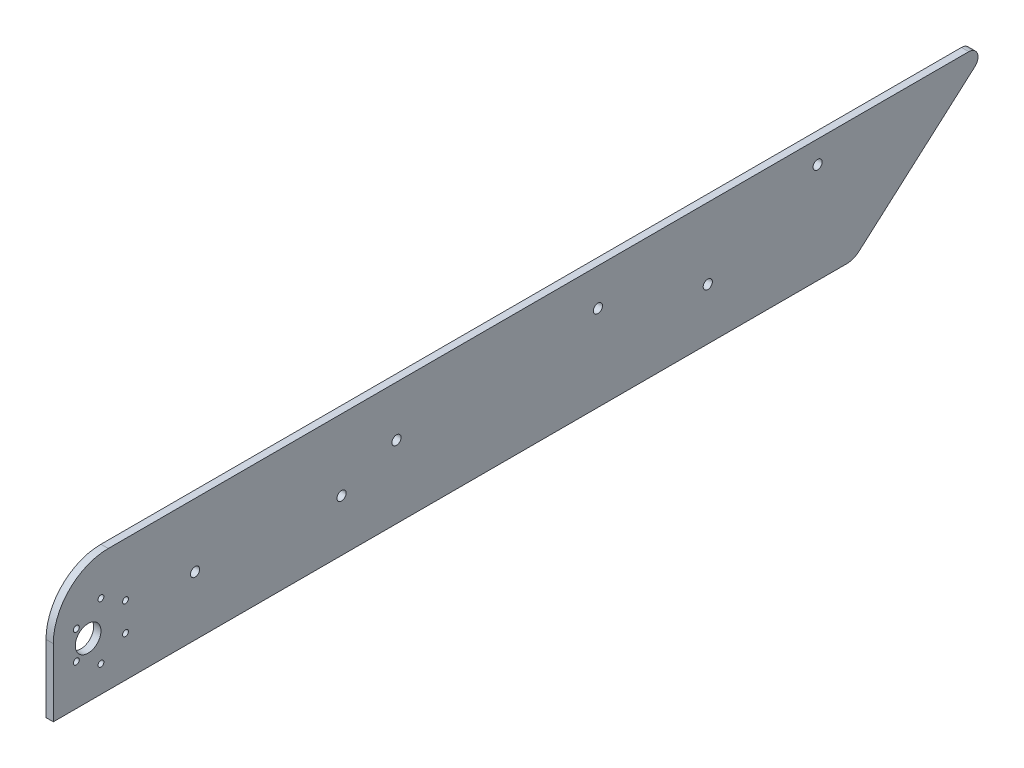
ISO-10303-21;
HEADER;
FILE_DESCRIPTION(('STEP AP214'),'2;1');
FILE_NAME('part.step','',(''),(''),'','','');
FILE_SCHEMA(('AUTOMOTIVE_DESIGN { 1 0 10303 214 1 1 1 1 }'));
ENDSEC;
DATA;
#1=APPLICATION_CONTEXT('core data for automotive mechanical design processes');
#2=APPLICATION_PROTOCOL_DEFINITION('international standard','automotive_design',2000,#1);
#3=PRODUCT_CONTEXT('',#1,'mechanical');
#4=PRODUCT('Part','Part','',(#3));
#5=PRODUCT_RELATED_PRODUCT_CATEGORY('part','',(#4));
#6=PRODUCT_DEFINITION_FORMATION('','',#4);
#7=PRODUCT_DEFINITION_CONTEXT('part definition',#1,'design');
#8=PRODUCT_DEFINITION('design','',#6,#7);
#9=PRODUCT_DEFINITION_SHAPE('','',#8);
#10=(LENGTH_UNIT() NAMED_UNIT(*) SI_UNIT(.MILLI.,.METRE.));
#11=(NAMED_UNIT(*) PLANE_ANGLE_UNIT() SI_UNIT($,.RADIAN.));
#12=(NAMED_UNIT(*) SI_UNIT($,.STERADIAN.) SOLID_ANGLE_UNIT());
#13=UNCERTAINTY_MEASURE_WITH_UNIT(LENGTH_MEASURE(1.E-05),#10,'distance_accuracy_value','');
#14=(GEOMETRIC_REPRESENTATION_CONTEXT(3) GLOBAL_UNCERTAINTY_ASSIGNED_CONTEXT((#13)) GLOBAL_UNIT_ASSIGNED_CONTEXT((#10,
#11,#12)) REPRESENTATION_CONTEXT('',''));
#15=CARTESIAN_POINT('',(0.,0.,0.));
#16=DIRECTION('',(0.,0.,1.));
#17=DIRECTION('',(1.,0.,0.));
#18=AXIS2_PLACEMENT_3D('',#15,#16,#17);
#19=CARTESIAN_POINT('',(-4.,2.99999999999992,-206.943801284862));
#20=DIRECTION('',(-1.,0.,0.));
#21=DIRECTION('',(0.,0.,1.));
#22=AXIS2_PLACEMENT_3D('',#19,#20,#21);
#23=PLANE('',#22);
#24=CARTESIAN_POINT('',(-4.,7.50688926243503,200.406668197782));
#25=DIRECTION('',(-1.,0.,0.));
#26=DIRECTION('',(0.,0.,1.));
#27=AXIS2_PLACEMENT_3D('',#24,#25,#26);
#28=CIRCLE('',#27,1.60000000000002);
#29=CARTESIAN_POINT('',(-4.,7.50688926243503,202.006668197782));
#30=VERTEX_POINT('',#29);
#31=EDGE_CURVE('E213',#30,#30,#28,.T.);
#32=ORIENTED_EDGE('',*,*,#31,.F.);
#33=EDGE_LOOP('',(#32));
#34=FACE_BOUND('',#33,.T.);
#35=CARTESIAN_POINT('',(-4.,30.7568892624349,186.983274439123));
#36=DIRECTION('',(-1.,0.,0.));
#37=DIRECTION('',(0.,0.,1.));
#38=AXIS2_PLACEMENT_3D('',#35,#36,#37);
#39=CIRCLE('',#38,1.60000000000002);
#40=CARTESIAN_POINT('',(-4.,30.7568892624349,188.583274439123));
#41=VERTEX_POINT('',#40);
#42=EDGE_CURVE('E201',#41,#41,#39,.T.);
#43=ORIENTED_EDGE('',*,*,#42,.F.);
#44=EDGE_LOOP('',(#43));
#45=FACE_BOUND('',#44,.T.);
#46=CARTESIAN_POINT('',(-4.,30.7568892624349,213.830061956441));
#47=DIRECTION('',(-1.,0.,0.));
#48=DIRECTION('',(0.,0.,1.));
#49=AXIS2_PLACEMENT_3D('',#46,#47,#48);
#50=CIRCLE('',#49,1.60000000000002);
#51=CARTESIAN_POINT('',(-4.,30.7568892624349,215.430061956441));
#52=VERTEX_POINT('',#51);
#53=EDGE_CURVE('E189',#52,#52,#50,.T.);
#54=ORIENTED_EDGE('',*,*,#53,.F.);
#55=EDGE_LOOP('',(#54));
#56=FACE_BOUND('',#55,.T.);
#57=CARTESIAN_POINT('',(-4.,21.2333792502818,68.9922577958479));
#58=DIRECTION('',(-1.,0.,0.));
#59=DIRECTION('',(0.,0.,1.));
#60=AXIS2_PLACEMENT_3D('',#57,#58,#59);
#61=CIRCLE('',#60,2.50000000000001);
#62=CARTESIAN_POINT('',(-4.,21.2333792502818,71.4922577958479));
#63=VERTEX_POINT('',#62);
#64=EDGE_CURVE('E177',#63,#63,#61,.T.);
#65=ORIENTED_EDGE('',*,*,#64,.F.);
#66=EDGE_LOOP('',(#65));
#67=FACE_BOUND('',#66,.T.);
#68=CARTESIAN_POINT('',(-4.,32.5498910613672,38.9922577958479));
#69=DIRECTION('',(-1.,0.,0.));
#70=DIRECTION('',(0.,0.,1.));
#71=AXIS2_PLACEMENT_3D('',#68,#69,#70);
#72=CIRCLE('',#71,2.5);
#73=CARTESIAN_POINT('',(-4.,32.5498910613672,41.4922577958479));
#74=VERTEX_POINT('',#73);
#75=EDGE_CURVE('E165',#74,#74,#72,.T.);
#76=ORIENTED_EDGE('',*,*,#75,.F.);
#77=EDGE_LOOP('',(#76));
#78=FACE_BOUND('',#77,.T.);
#79=CARTESIAN_POINT('',(-4.,47.8480521209096,-191.007742204152));
#80=DIRECTION('',(-1.,0.,0.));
#81=DIRECTION('',(0.,0.,1.));
#82=AXIS2_PLACEMENT_3D('',#79,#80,#81);
#83=CIRCLE('',#82,2.5);
#84=CARTESIAN_POINT('',(-4.,47.8480521209096,-188.507742204152));
#85=VERTEX_POINT('',#84);
#86=EDGE_CURVE('E153',#85,#85,#83,.T.);
#87=ORIENTED_EDGE('',*,*,#86,.F.);
#88=EDGE_LOOP('',(#87));
#89=FACE_BOUND('',#88,.T.);
#90=DIRECTION('',(0.,1.,0.));
#91=VECTOR('',#90,1.);
#92=CARTESIAN_POINT('',(-4.,59.9999999999993,226.406668197782));
#93=LINE('',#92,#91);
#94=CARTESIAN_POINT('',(-4.,-7.00000000000008,226.406668197782));
#95=VERTEX_POINT('',#94);
#96=CARTESIAN_POINT('',(-4.,29.9999999999993,226.406668197782));
#97=VERTEX_POINT('',#96);
#98=EDGE_CURVE('E103',#95,#97,#93,.T.);
#99=ORIENTED_EDGE('',*,*,#98,.T.);
#100=CARTESIAN_POINT('',(-4.,29.9999999999993,196.406668197782));
#101=DIRECTION('',(-1.,0.,0.));
#102=DIRECTION('',(0.,0.,1.));
#103=AXIS2_PLACEMENT_3D('',#100,#101,#102);
#104=CIRCLE('',#103,30.);
#105=CARTESIAN_POINT('',(-4.,59.9999999999993,196.406668197782));
#106=VERTEX_POINT('',#105);
#107=EDGE_CURVE('E11',#97,#106,#104,.T.);
#108=ORIENTED_EDGE('',*,*,#107,.T.);
#109=DIRECTION('',(0.,0.,-1.));
#110=VECTOR('',#109,1.);
#111=CARTESIAN_POINT('',(-4.,59.9999999999993,226.406668197782));
#112=LINE('',#111,#110);
#113=CARTESIAN_POINT('',(-4.,59.9999999999992,-273.593331802218));
#114=VERTEX_POINT('',#113);
#115=EDGE_CURVE('E147',#106,#114,#112,.T.);
#116=ORIENTED_EDGE('',*,*,#115,.T.);
#117=CARTESIAN_POINT('',(-4.,54.9999999999994,-273.593331802218));
#118=DIRECTION('',(-1.,0.,0.));
#119=DIRECTION('',(0.,0.,1.));
#120=AXIS2_PLACEMENT_3D('',#117,#118,#119);
#121=CIRCLE('',#120,4.99999999999981);
#122=CARTESIAN_POINT('',(-4.,51.2466893529715,-276.896763228312));
#123=VERTEX_POINT('',#122);
#124=EDGE_CURVE('E145',#114,#123,#121,.T.);
#125=ORIENTED_EDGE('',*,*,#124,.T.);
#126=DIRECTION('',(0.,-0.66068628521883,0.750662129405595));
#127=VECTOR('',#126,1.);
#128=CARTESIAN_POINT('',(-4.,51.2466893529715,-276.896763228312));
#129=LINE('',#128,#127);
#130=CARTESIAN_POINT('',(-4.,-4.50662129405601,-213.55066413705));
#131=VERTEX_POINT('',#130);
#132=EDGE_CURVE('E109',#123,#131,#129,.T.);
#133=ORIENTED_EDGE('',*,*,#132,.T.);
#134=CARTESIAN_POINT('',(-4.,2.99999999999992,-206.943801284862));
#135=DIRECTION('',(-1.,0.,0.));
#136=DIRECTION('',(0.,0.,1.));
#137=AXIS2_PLACEMENT_3D('',#134,#135,#136);
#138=CIRCLE('',#137,10.);
#139=CARTESIAN_POINT('',(-4.,-7.00000000000009,-206.943801284862));
#140=VERTEX_POINT('',#139);
#141=EDGE_CURVE('E104',#131,#140,#138,.T.);
#142=ORIENTED_EDGE('',*,*,#141,.T.);
#143=DIRECTION('',(0.,0.,1.));
#144=VECTOR('',#143,1.);
#145=CARTESIAN_POINT('',(-4.,-7.00000000000009,-206.943801284862));
#146=LINE('',#145,#144);
#147=EDGE_CURVE('E94',#140,#95,#146,.T.);
#148=ORIENTED_EDGE('',*,*,#147,.T.);
#149=EDGE_LOOP('',(#99,#108,#116,#125,#133,#142,#148));
#150=FACE_BOUND('',#149,.T.);
#151=CARTESIAN_POINT('',(-4.,23.006889262435,207.406668197782));
#152=DIRECTION('',(-1.,0.,0.));
#153=DIRECTION('',(0.,0.,1.));
#154=AXIS2_PLACEMENT_3D('',#151,#152,#153);
#155=CIRCLE('',#154,7.00000000000001);
#156=CARTESIAN_POINT('',(-4.,23.006889262435,214.406668197782));
#157=VERTEX_POINT('',#156);
#158=EDGE_CURVE('E143',#157,#157,#155,.T.);
#159=ORIENTED_EDGE('',*,*,#158,.F.);
#160=EDGE_LOOP('',(#159));
#161=FACE_BOUND('',#160,.T.);
#162=CARTESIAN_POINT('',(-4.,39.8664028724528,-71.0077422041521));
#163=DIRECTION('',(-1.,0.,0.));
#164=DIRECTION('',(0.,0.,1.));
#165=AXIS2_PLACEMENT_3D('',#162,#163,#164);
#166=CIRCLE('',#165,2.5);
#167=CARTESIAN_POINT('',(-4.,39.8664028724528,-68.5077422041521));
#168=VERTEX_POINT('',#167);
#169=EDGE_CURVE('E159',#168,#168,#166,.T.);
#170=ORIENTED_EDGE('',*,*,#169,.F.);
#171=EDGE_LOOP('',(#170));
#172=FACE_BOUND('',#171,.T.);
#173=CARTESIAN_POINT('',(-4.,21.2333792502818,-131.007742204152));
#174=DIRECTION('',(-1.,0.,0.));
#175=DIRECTION('',(0.,0.,1.));
#176=AXIS2_PLACEMENT_3D('',#173,#174,#175);
#177=CIRCLE('',#176,2.5);
#178=CARTESIAN_POINT('',(-4.,21.2333792502818,-128.507742204152));
#179=VERTEX_POINT('',#178);
#180=EDGE_CURVE('E171',#179,#179,#177,.T.);
#181=ORIENTED_EDGE('',*,*,#180,.F.);
#182=EDGE_LOOP('',(#181));
#183=FACE_BOUND('',#182,.T.);
#184=CARTESIAN_POINT('',(-4.,25.2333792502818,148.992257795848));
#185=DIRECTION('',(-1.,0.,0.));
#186=DIRECTION('',(0.,0.,1.));
#187=AXIS2_PLACEMENT_3D('',#184,#185,#186);
#188=CIRCLE('',#187,2.5);
#189=CARTESIAN_POINT('',(-4.,25.2333792502818,151.492257795848));
#190=VERTEX_POINT('',#189);
#191=EDGE_CURVE('E183',#190,#190,#188,.T.);
#192=ORIENTED_EDGE('',*,*,#191,.F.);
#193=EDGE_LOOP('',(#192));
#194=FACE_BOUND('',#193,.T.);
#195=CARTESIAN_POINT('',(-4.,38.5068892624351,200.406668197782));
#196=DIRECTION('',(-1.,0.,0.));
#197=DIRECTION('',(0.,0.,1.));
#198=AXIS2_PLACEMENT_3D('',#195,#196,#197);
#199=CIRCLE('',#198,1.60000000000002);
#200=CARTESIAN_POINT('',(-4.,38.5068892624351,202.006668197782));
#201=VERTEX_POINT('',#200);
#202=EDGE_CURVE('E195',#201,#201,#199,.T.);
#203=ORIENTED_EDGE('',*,*,#202,.F.);
#204=EDGE_LOOP('',(#203));
#205=FACE_BOUND('',#204,.T.);
#206=CARTESIAN_POINT('',(-4.,15.256889262435,186.983274439123));
#207=DIRECTION('',(-1.,0.,0.));
#208=DIRECTION('',(0.,0.,1.));
#209=AXIS2_PLACEMENT_3D('',#206,#207,#208);
#210=CIRCLE('',#209,1.60000000000002);
#211=CARTESIAN_POINT('',(-4.,15.256889262435,188.583274439123));
#212=VERTEX_POINT('',#211);
#213=EDGE_CURVE('E207',#212,#212,#210,.T.);
#214=ORIENTED_EDGE('',*,*,#213,.F.);
#215=EDGE_LOOP('',(#214));
#216=FACE_BOUND('',#215,.T.);
#217=CARTESIAN_POINT('',(-4.,15.256889262435,213.830061956441));
#218=DIRECTION('',(-1.,0.,0.));
#219=DIRECTION('',(0.,0.,1.));
#220=AXIS2_PLACEMENT_3D('',#217,#218,#219);
#221=CIRCLE('',#220,1.60000000000002);
#222=CARTESIAN_POINT('',(-4.,15.256889262435,215.430061956441));
#223=VERTEX_POINT('',#222);
#224=EDGE_CURVE('E219',#223,#223,#221,.T.);
#225=ORIENTED_EDGE('',*,*,#224,.F.);
#226=EDGE_LOOP('',(#225));
#227=FACE_BOUND('',#226,.T.);
#228=ADVANCED_FACE('F35',(#34,#45,#56,#67,#78,#89,#150,#161,#172,#183,#194,#205,#216,#227),#23,.T.);
#229=CARTESIAN_POINT('',(0.,2.99999999999992,-206.943801284862));
#230=DIRECTION('',(-1.,0.,0.));
#231=DIRECTION('',(0.,0.,1.));
#232=AXIS2_PLACEMENT_3D('',#229,#230,#231);
#233=PLANE('',#232);
#234=DIRECTION('',(0.,0.,-1.));
#235=VECTOR('',#234,1.);
#236=CARTESIAN_POINT('',(0.,59.9999999999993,226.406668197782));
#237=LINE('',#236,#235);
#238=CARTESIAN_POINT('',(0.,59.9999999999993,196.406668197782));
#239=VERTEX_POINT('',#238);
#240=CARTESIAN_POINT('',(0.,59.9999999999992,-273.593331802218));
#241=VERTEX_POINT('',#240);
#242=EDGE_CURVE('E136',#239,#241,#237,.T.);
#243=ORIENTED_EDGE('',*,*,#242,.F.);
#244=CARTESIAN_POINT('',(0.,29.9999999999993,196.406668197782));
#245=DIRECTION('',(-1.,0.,0.));
#246=DIRECTION('',(0.,0.,1.));
#247=AXIS2_PLACEMENT_3D('',#244,#245,#246);
#248=CIRCLE('',#247,30.);
#249=CARTESIAN_POINT('',(0.,29.9999999999993,226.406668197782));
#250=VERTEX_POINT('',#249);
#251=EDGE_CURVE('E57',#239,#250,#248,.F.);
#252=ORIENTED_EDGE('',*,*,#251,.T.);
#253=DIRECTION('',(0.,1.,0.));
#254=VECTOR('',#253,1.);
#255=CARTESIAN_POINT('',(0.,59.9999999999993,226.406668197782));
#256=LINE('',#255,#254);
#257=CARTESIAN_POINT('',(0.,-7.00000000000008,226.406668197782));
#258=VERTEX_POINT('',#257);
#259=EDGE_CURVE('E138',#258,#250,#256,.T.);
#260=ORIENTED_EDGE('',*,*,#259,.F.);
#261=DIRECTION('',(0.,0.,1.));
#262=VECTOR('',#261,1.);
#263=CARTESIAN_POINT('',(0.,-7.00000000000009,-206.943801284862));
#264=LINE('',#263,#262);
#265=CARTESIAN_POINT('',(0.,-7.00000000000009,-206.943801284862));
#266=VERTEX_POINT('',#265);
#267=EDGE_CURVE('E140',#266,#258,#264,.T.);
#268=ORIENTED_EDGE('',*,*,#267,.F.);
#269=CARTESIAN_POINT('',(0.,2.99999999999992,-206.943801284862));
#270=DIRECTION('',(-1.,0.,0.));
#271=DIRECTION('',(0.,0.,1.));
#272=AXIS2_PLACEMENT_3D('',#269,#270,#271);
#273=CIRCLE('',#272,10.);
#274=CARTESIAN_POINT('',(0.,-4.50662129405601,-213.55066413705));
#275=VERTEX_POINT('',#274);
#276=EDGE_CURVE('E117',#275,#266,#273,.T.);
#277=ORIENTED_EDGE('',*,*,#276,.F.);
#278=DIRECTION('',(0.,-0.66068628521883,0.750662129405595));
#279=VECTOR('',#278,1.);
#280=CARTESIAN_POINT('',(0.,51.2466893529715,-276.896763228312));
#281=LINE('',#280,#279);
#282=CARTESIAN_POINT('',(0.,51.2466893529715,-276.896763228312));
#283=VERTEX_POINT('',#282);
#284=EDGE_CURVE('E113',#283,#275,#281,.T.);
#285=ORIENTED_EDGE('',*,*,#284,.F.);
#286=CARTESIAN_POINT('',(0.,54.9999999999994,-273.593331802218));
#287=DIRECTION('',(-1.,0.,0.));
#288=DIRECTION('',(0.,0.,1.));
#289=AXIS2_PLACEMENT_3D('',#286,#287,#288);
#290=CIRCLE('',#289,4.99999999999981);
#291=EDGE_CURVE('E134',#241,#283,#290,.T.);
#292=ORIENTED_EDGE('',*,*,#291,.F.);
#293=EDGE_LOOP('',(#243,#252,#260,#268,#277,#285,#292));
#294=FACE_BOUND('',#293,.T.);
#295=CARTESIAN_POINT('',(0.,23.006889262435,207.406668197782));
#296=DIRECTION('',(-1.,0.,0.));
#297=DIRECTION('',(0.,0.,1.));
#298=AXIS2_PLACEMENT_3D('',#295,#296,#297);
#299=CIRCLE('',#298,7.00000000000001);
#300=CARTESIAN_POINT('',(0.,23.006889262435,214.406668197782));
#301=VERTEX_POINT('',#300);
#302=EDGE_CURVE('E150',#301,#301,#299,.T.);
#303=ORIENTED_EDGE('',*,*,#302,.T.);
#304=EDGE_LOOP('',(#303));
#305=FACE_BOUND('',#304,.T.);
#306=CARTESIAN_POINT('',(0.,47.8480521209096,-191.007742204152));
#307=DIRECTION('',(-1.,0.,0.));
#308=DIRECTION('',(0.,0.,1.));
#309=AXIS2_PLACEMENT_3D('',#306,#307,#308);
#310=CIRCLE('',#309,2.5);
#311=CARTESIAN_POINT('',(0.,47.8480521209096,-188.507742204152));
#312=VERTEX_POINT('',#311);
#313=EDGE_CURVE('E156',#312,#312,#310,.T.);
#314=ORIENTED_EDGE('',*,*,#313,.T.);
#315=EDGE_LOOP('',(#314));
#316=FACE_BOUND('',#315,.T.);
#317=CARTESIAN_POINT('',(0.,39.8664028724528,-71.0077422041521));
#318=DIRECTION('',(-1.,0.,0.));
#319=DIRECTION('',(0.,0.,1.));
#320=AXIS2_PLACEMENT_3D('',#317,#318,#319);
#321=CIRCLE('',#320,2.5);
#322=CARTESIAN_POINT('',(0.,39.8664028724528,-68.5077422041521));
#323=VERTEX_POINT('',#322);
#324=EDGE_CURVE('E162',#323,#323,#321,.T.);
#325=ORIENTED_EDGE('',*,*,#324,.T.);
#326=EDGE_LOOP('',(#325));
#327=FACE_BOUND('',#326,.T.);
#328=CARTESIAN_POINT('',(0.,32.5498910613672,38.9922577958479));
#329=DIRECTION('',(-1.,0.,0.));
#330=DIRECTION('',(0.,0.,1.));
#331=AXIS2_PLACEMENT_3D('',#328,#329,#330);
#332=CIRCLE('',#331,2.5);
#333=CARTESIAN_POINT('',(0.,32.5498910613672,41.4922577958479));
#334=VERTEX_POINT('',#333);
#335=EDGE_CURVE('E168',#334,#334,#332,.T.);
#336=ORIENTED_EDGE('',*,*,#335,.T.);
#337=EDGE_LOOP('',(#336));
#338=FACE_BOUND('',#337,.T.);
#339=CARTESIAN_POINT('',(0.,21.2333792502818,-131.007742204152));
#340=DIRECTION('',(-1.,0.,0.));
#341=DIRECTION('',(0.,0.,1.));
#342=AXIS2_PLACEMENT_3D('',#339,#340,#341);
#343=CIRCLE('',#342,2.5);
#344=CARTESIAN_POINT('',(0.,21.2333792502818,-128.507742204152));
#345=VERTEX_POINT('',#344);
#346=EDGE_CURVE('E174',#345,#345,#343,.T.);
#347=ORIENTED_EDGE('',*,*,#346,.T.);
#348=EDGE_LOOP('',(#347));
#349=FACE_BOUND('',#348,.T.);
#350=CARTESIAN_POINT('',(0.,21.2333792502818,68.9922577958479));
#351=DIRECTION('',(-1.,0.,0.));
#352=DIRECTION('',(0.,0.,1.));
#353=AXIS2_PLACEMENT_3D('',#350,#351,#352);
#354=CIRCLE('',#353,2.50000000000001);
#355=CARTESIAN_POINT('',(0.,21.2333792502818,71.4922577958479));
#356=VERTEX_POINT('',#355);
#357=EDGE_CURVE('E180',#356,#356,#354,.T.);
#358=ORIENTED_EDGE('',*,*,#357,.T.);
#359=EDGE_LOOP('',(#358));
#360=FACE_BOUND('',#359,.T.);
#361=CARTESIAN_POINT('',(0.,25.2333792502818,148.992257795848));
#362=DIRECTION('',(-1.,0.,0.));
#363=DIRECTION('',(0.,0.,1.));
#364=AXIS2_PLACEMENT_3D('',#361,#362,#363);
#365=CIRCLE('',#364,2.5);
#366=CARTESIAN_POINT('',(0.,25.2333792502818,151.492257795848));
#367=VERTEX_POINT('',#366);
#368=EDGE_CURVE('E186',#367,#367,#365,.T.);
#369=ORIENTED_EDGE('',*,*,#368,.T.);
#370=EDGE_LOOP('',(#369));
#371=FACE_BOUND('',#370,.T.);
#372=CARTESIAN_POINT('',(0.,30.7568892624349,213.830061956441));
#373=DIRECTION('',(-1.,0.,0.));
#374=DIRECTION('',(0.,0.,1.));
#375=AXIS2_PLACEMENT_3D('',#372,#373,#374);
#376=CIRCLE('',#375,1.60000000000002);
#377=CARTESIAN_POINT('',(0.,30.7568892624349,215.430061956441));
#378=VERTEX_POINT('',#377);
#379=EDGE_CURVE('E192',#378,#378,#376,.T.);
#380=ORIENTED_EDGE('',*,*,#379,.T.);
#381=EDGE_LOOP('',(#380));
#382=FACE_BOUND('',#381,.T.);
#383=CARTESIAN_POINT('',(0.,38.5068892624351,200.406668197782));
#384=DIRECTION('',(-1.,0.,0.));
#385=DIRECTION('',(0.,0.,1.));
#386=AXIS2_PLACEMENT_3D('',#383,#384,#385);
#387=CIRCLE('',#386,1.60000000000002);
#388=CARTESIAN_POINT('',(0.,38.5068892624351,202.006668197782));
#389=VERTEX_POINT('',#388);
#390=EDGE_CURVE('E198',#389,#389,#387,.T.);
#391=ORIENTED_EDGE('',*,*,#390,.T.);
#392=EDGE_LOOP('',(#391));
#393=FACE_BOUND('',#392,.T.);
#394=CARTESIAN_POINT('',(0.,30.7568892624349,186.983274439123));
#395=DIRECTION('',(-1.,0.,0.));
#396=DIRECTION('',(0.,0.,1.));
#397=AXIS2_PLACEMENT_3D('',#394,#395,#396);
#398=CIRCLE('',#397,1.60000000000002);
#399=CARTESIAN_POINT('',(0.,30.7568892624349,188.583274439123));
#400=VERTEX_POINT('',#399);
#401=EDGE_CURVE('E204',#400,#400,#398,.T.);
#402=ORIENTED_EDGE('',*,*,#401,.T.);
#403=EDGE_LOOP('',(#402));
#404=FACE_BOUND('',#403,.T.);
#405=CARTESIAN_POINT('',(0.,15.256889262435,186.983274439123));
#406=DIRECTION('',(-1.,0.,0.));
#407=DIRECTION('',(0.,0.,1.));
#408=AXIS2_PLACEMENT_3D('',#405,#406,#407);
#409=CIRCLE('',#408,1.60000000000002);
#410=CARTESIAN_POINT('',(0.,15.256889262435,188.583274439123));
#411=VERTEX_POINT('',#410);
#412=EDGE_CURVE('E210',#411,#411,#409,.T.);
#413=ORIENTED_EDGE('',*,*,#412,.T.);
#414=EDGE_LOOP('',(#413));
#415=FACE_BOUND('',#414,.T.);
#416=CARTESIAN_POINT('',(0.,7.50688926243503,200.406668197782));
#417=DIRECTION('',(-1.,0.,0.));
#418=DIRECTION('',(0.,0.,1.));
#419=AXIS2_PLACEMENT_3D('',#416,#417,#418);
#420=CIRCLE('',#419,1.60000000000002);
#421=CARTESIAN_POINT('',(0.,7.50688926243503,202.006668197782));
#422=VERTEX_POINT('',#421);
#423=EDGE_CURVE('E216',#422,#422,#420,.T.);
#424=ORIENTED_EDGE('',*,*,#423,.T.);
#425=EDGE_LOOP('',(#424));
#426=FACE_BOUND('',#425,.T.);
#427=CARTESIAN_POINT('',(0.,15.256889262435,213.830061956441));
#428=DIRECTION('',(-1.,0.,0.));
#429=DIRECTION('',(0.,0.,1.));
#430=AXIS2_PLACEMENT_3D('',#427,#428,#429);
#431=CIRCLE('',#430,1.60000000000002);
#432=CARTESIAN_POINT('',(0.,15.256889262435,215.430061956441));
#433=VERTEX_POINT('',#432);
#434=EDGE_CURVE('E222',#433,#433,#431,.T.);
#435=ORIENTED_EDGE('',*,*,#434,.T.);
#436=EDGE_LOOP('',(#435));
#437=FACE_BOUND('',#436,.T.);
#438=ADVANCED_FACE('F232',(#294,#305,#316,#327,#338,#349,#360,#371,#382,#393,#404,#415,#426,
#437),#233,.F.);
#439=CARTESIAN_POINT('',(-4.,2.99999999999992,-206.943801284862));
#440=DIRECTION('',(1.,0.,0.));
#441=DIRECTION('',(0.,0.,-1.));
#442=AXIS2_PLACEMENT_3D('',#439,#440,#441);
#443=CYLINDRICAL_SURFACE('',#442,10.);
#444=ORIENTED_EDGE('',*,*,#276,.T.);
#445=DIRECTION('',(1.,0.,0.));
#446=VECTOR('',#445,1.);
#447=CARTESIAN_POINT('',(-4.,-7.00000000000009,-206.943801284862));
#448=LINE('',#447,#446);
#449=EDGE_CURVE('E98',#140,#266,#448,.T.);
#450=ORIENTED_EDGE('',*,*,#449,.F.);
#451=ORIENTED_EDGE('',*,*,#141,.F.);
#452=DIRECTION('',(1.,0.,0.));
#453=VECTOR('',#452,1.);
#454=CARTESIAN_POINT('',(-4.,-4.50662129405601,-213.55066413705));
#455=LINE('',#454,#453);
#456=EDGE_CURVE('E131',#131,#275,#455,.T.);
#457=ORIENTED_EDGE('',*,*,#456,.T.);
#458=EDGE_LOOP('',(#444,#450,#451,#457));
#459=FACE_BOUND('',#458,.T.);
#460=ADVANCED_FACE('F115',(#459),#443,.T.);
#461=CARTESIAN_POINT('',(-4.,-7.00000000000009,-206.943801284862));
#462=DIRECTION('',(0.,1.,0.));
#463=DIRECTION('',(0.,0.,1.));
#464=AXIS2_PLACEMENT_3D('',#461,#462,#463);
#465=PLANE('',#464);
#466=ORIENTED_EDGE('',*,*,#267,.T.);
#467=DIRECTION('',(1.,0.,0.));
#468=VECTOR('',#467,1.);
#469=CARTESIAN_POINT('',(-4.,-7.00000000000008,226.406668197782));
#470=LINE('',#469,#468);
#471=EDGE_CURVE('E101',#95,#258,#470,.T.);
#472=ORIENTED_EDGE('',*,*,#471,.F.);
#473=ORIENTED_EDGE('',*,*,#147,.F.);
#474=ORIENTED_EDGE('',*,*,#449,.T.);
#475=EDGE_LOOP('',(#466,#472,#473,#474));
#476=FACE_BOUND('',#475,.T.);
#477=ADVANCED_FACE('F96',(#476),#465,.F.);
#478=CARTESIAN_POINT('',(-4.,59.9999999999993,226.406668197782));
#479=DIRECTION('',(0.,0.,-1.));
#480=DIRECTION('',(-1.,0.,0.));
#481=AXIS2_PLACEMENT_3D('',#478,#479,#480);
#482=PLANE('',#481);
#483=ORIENTED_EDGE('',*,*,#259,.T.);
#484=DIRECTION('',(1.,0.,0.));
#485=VECTOR('',#484,1.);
#486=CARTESIAN_POINT('',(-4.,29.9999999999993,226.406668197782));
#487=LINE('',#486,#485);
#488=EDGE_CURVE('E43',#250,#97,#487,.F.);
#489=ORIENTED_EDGE('',*,*,#488,.T.);
#490=ORIENTED_EDGE('',*,*,#98,.F.);
#491=ORIENTED_EDGE('',*,*,#471,.T.);
#492=EDGE_LOOP('',(#483,#489,#490,#491));
#493=FACE_BOUND('',#492,.T.);
#494=ADVANCED_FACE('F256',(#493),#482,.F.);
#495=CARTESIAN_POINT('',(-4.,59.9999999999993,226.406668197782));
#496=DIRECTION('',(0.,-1.,0.));
#497=DIRECTION('',(0.,0.,-1.));
#498=AXIS2_PLACEMENT_3D('',#495,#496,#497);
#499=PLANE('',#498);
#500=ORIENTED_EDGE('',*,*,#115,.F.);
#501=DIRECTION('',(1.,0.,0.));
#502=VECTOR('',#501,1.);
#503=CARTESIAN_POINT('',(-4.,59.9999999999993,196.406668197782));
#504=LINE('',#503,#502);
#505=EDGE_CURVE('E118',#106,#239,#504,.T.);
#506=ORIENTED_EDGE('',*,*,#505,.T.);
#507=ORIENTED_EDGE('',*,*,#242,.T.);
#508=DIRECTION('',(1.,0.,0.));
#509=VECTOR('',#508,1.);
#510=CARTESIAN_POINT('',(-4.,59.9999999999992,-273.593331802218));
#511=LINE('',#510,#509);
#512=EDGE_CURVE('E122',#114,#241,#511,.T.);
#513=ORIENTED_EDGE('',*,*,#512,.F.);
#514=EDGE_LOOP('',(#500,#506,#507,#513));
#515=FACE_BOUND('',#514,.T.);
#516=ADVANCED_FACE('F252',(#515),#499,.F.);
#517=CARTESIAN_POINT('',(-4.,54.9999999999994,-273.593331802218));
#518=DIRECTION('',(1.,0.,0.));
#519=DIRECTION('',(0.,0.,-1.));
#520=AXIS2_PLACEMENT_3D('',#517,#518,#519);
#521=CYLINDRICAL_SURFACE('',#520,4.99999999999981);
#522=ORIENTED_EDGE('',*,*,#291,.T.);
#523=DIRECTION('',(1.,0.,0.));
#524=VECTOR('',#523,1.);
#525=CARTESIAN_POINT('',(-4.,51.2466893529715,-276.896763228312));
#526=LINE('',#525,#524);
#527=EDGE_CURVE('E128',#123,#283,#526,.T.);
#528=ORIENTED_EDGE('',*,*,#527,.F.);
#529=ORIENTED_EDGE('',*,*,#124,.F.);
#530=ORIENTED_EDGE('',*,*,#512,.T.);
#531=EDGE_LOOP('',(#522,#528,#529,#530));
#532=FACE_BOUND('',#531,.T.);
#533=ADVANCED_FACE('F248',(#532),#521,.T.);
#534=CARTESIAN_POINT('',(-4.,51.2466893529715,-276.896763228312));
#535=DIRECTION('',(0.,0.750662129405595,0.66068628521883));
#536=DIRECTION('',(0.,-0.66068628521883,0.750662129405595));
#537=AXIS2_PLACEMENT_3D('',#534,#535,#536);
#538=PLANE('',#537);
#539=ORIENTED_EDGE('',*,*,#284,.T.);
#540=ORIENTED_EDGE('',*,*,#456,.F.);
#541=ORIENTED_EDGE('',*,*,#132,.F.);
#542=ORIENTED_EDGE('',*,*,#527,.T.);
#543=EDGE_LOOP('',(#539,#540,#541,#542));
#544=FACE_BOUND('',#543,.T.);
#545=ADVANCED_FACE('F245',(#544),#538,.F.);
#546=CARTESIAN_POINT('',(-4.,23.006889262435,207.406668197782));
#547=DIRECTION('',(1.,0.,0.));
#548=DIRECTION('',(0.,0.,-1.));
#549=AXIS2_PLACEMENT_3D('',#546,#547,#548);
#550=CYLINDRICAL_SURFACE('',#549,7.00000000000001);
#551=ORIENTED_EDGE('',*,*,#158,.T.);
#552=EDGE_LOOP('',(#551));
#553=FACE_BOUND('',#552,.T.);
#554=ORIENTED_EDGE('',*,*,#302,.F.);
#555=EDGE_LOOP('',(#554));
#556=FACE_BOUND('',#555,.T.);
#557=ADVANCED_FACE('F242',(#553,#556),#550,.F.);
#558=CARTESIAN_POINT('',(-4.,47.8480521209096,-191.007742204152));
#559=DIRECTION('',(1.,0.,0.));
#560=DIRECTION('',(0.,0.,-1.));
#561=AXIS2_PLACEMENT_3D('',#558,#559,#560);
#562=CYLINDRICAL_SURFACE('',#561,2.5);
#563=ORIENTED_EDGE('',*,*,#86,.T.);
#564=EDGE_LOOP('',(#563));
#565=FACE_BOUND('',#564,.T.);
#566=ORIENTED_EDGE('',*,*,#313,.F.);
#567=EDGE_LOOP('',(#566));
#568=FACE_BOUND('',#567,.T.);
#569=ADVANCED_FACE('F293',(#565,#568),#562,.F.);
#570=CARTESIAN_POINT('',(-4.,39.8664028724528,-71.0077422041521));
#571=DIRECTION('',(1.,0.,0.));
#572=DIRECTION('',(0.,0.,-1.));
#573=AXIS2_PLACEMENT_3D('',#570,#571,#572);
#574=CYLINDRICAL_SURFACE('',#573,2.5);
#575=ORIENTED_EDGE('',*,*,#169,.T.);
#576=EDGE_LOOP('',(#575));
#577=FACE_BOUND('',#576,.T.);
#578=ORIENTED_EDGE('',*,*,#324,.F.);
#579=EDGE_LOOP('',(#578));
#580=FACE_BOUND('',#579,.T.);
#581=ADVANCED_FACE('F300',(#577,#580),#574,.F.);
#582=CARTESIAN_POINT('',(-4.,32.5498910613672,38.9922577958479));
#583=DIRECTION('',(1.,0.,0.));
#584=DIRECTION('',(0.,0.,-1.));
#585=AXIS2_PLACEMENT_3D('',#582,#583,#584);
#586=CYLINDRICAL_SURFACE('',#585,2.5);
#587=ORIENTED_EDGE('',*,*,#75,.T.);
#588=EDGE_LOOP('',(#587));
#589=FACE_BOUND('',#588,.T.);
#590=ORIENTED_EDGE('',*,*,#335,.F.);
#591=EDGE_LOOP('',(#590));
#592=FACE_BOUND('',#591,.T.);
#593=ADVANCED_FACE('F307',(#589,#592),#586,.F.);
#594=CARTESIAN_POINT('',(-4.,21.2333792502818,-131.007742204152));
#595=DIRECTION('',(1.,0.,0.));
#596=DIRECTION('',(0.,0.,-1.));
#597=AXIS2_PLACEMENT_3D('',#594,#595,#596);
#598=CYLINDRICAL_SURFACE('',#597,2.5);
#599=ORIENTED_EDGE('',*,*,#180,.T.);
#600=EDGE_LOOP('',(#599));
#601=FACE_BOUND('',#600,.T.);
#602=ORIENTED_EDGE('',*,*,#346,.F.);
#603=EDGE_LOOP('',(#602));
#604=FACE_BOUND('',#603,.T.);
#605=ADVANCED_FACE('F315',(#601,#604),#598,.F.);
#606=CARTESIAN_POINT('',(-4.,21.2333792502818,68.9922577958479));
#607=DIRECTION('',(1.,0.,0.));
#608=DIRECTION('',(0.,0.,-1.));
#609=AXIS2_PLACEMENT_3D('',#606,#607,#608);
#610=CYLINDRICAL_SURFACE('',#609,2.50000000000001);
#611=ORIENTED_EDGE('',*,*,#64,.T.);
#612=EDGE_LOOP('',(#611));
#613=FACE_BOUND('',#612,.T.);
#614=ORIENTED_EDGE('',*,*,#357,.F.);
#615=EDGE_LOOP('',(#614));
#616=FACE_BOUND('',#615,.T.);
#617=ADVANCED_FACE('F323',(#613,#616),#610,.F.);
#618=CARTESIAN_POINT('',(-4.,25.2333792502818,148.992257795848));
#619=DIRECTION('',(1.,0.,0.));
#620=DIRECTION('',(0.,0.,-1.));
#621=AXIS2_PLACEMENT_3D('',#618,#619,#620);
#622=CYLINDRICAL_SURFACE('',#621,2.5);
#623=ORIENTED_EDGE('',*,*,#191,.T.);
#624=EDGE_LOOP('',(#623));
#625=FACE_BOUND('',#624,.T.);
#626=ORIENTED_EDGE('',*,*,#368,.F.);
#627=EDGE_LOOP('',(#626));
#628=FACE_BOUND('',#627,.T.);
#629=ADVANCED_FACE('F331',(#625,#628),#622,.F.);
#630=CARTESIAN_POINT('',(-4.,30.7568892624349,213.830061956441));
#631=DIRECTION('',(1.,0.,0.));
#632=DIRECTION('',(0.,0.,-1.));
#633=AXIS2_PLACEMENT_3D('',#630,#631,#632);
#634=CYLINDRICAL_SURFACE('',#633,1.60000000000002);
#635=ORIENTED_EDGE('',*,*,#53,.T.);
#636=EDGE_LOOP('',(#635));
#637=FACE_BOUND('',#636,.T.);
#638=ORIENTED_EDGE('',*,*,#379,.F.);
#639=EDGE_LOOP('',(#638));
#640=FACE_BOUND('',#639,.T.);
#641=ADVANCED_FACE('F339',(#637,#640),#634,.F.);
#642=CARTESIAN_POINT('',(-4.,38.5068892624351,200.406668197782));
#643=DIRECTION('',(1.,0.,0.));
#644=DIRECTION('',(0.,0.,-1.));
#645=AXIS2_PLACEMENT_3D('',#642,#643,#644);
#646=CYLINDRICAL_SURFACE('',#645,1.60000000000002);
#647=ORIENTED_EDGE('',*,*,#202,.T.);
#648=EDGE_LOOP('',(#647));
#649=FACE_BOUND('',#648,.T.);
#650=ORIENTED_EDGE('',*,*,#390,.F.);
#651=EDGE_LOOP('',(#650));
#652=FACE_BOUND('',#651,.T.);
#653=ADVANCED_FACE('F347',(#649,#652),#646,.F.);
#654=CARTESIAN_POINT('',(-4.,30.7568892624349,186.983274439123));
#655=DIRECTION('',(1.,0.,0.));
#656=DIRECTION('',(0.,0.,-1.));
#657=AXIS2_PLACEMENT_3D('',#654,#655,#656);
#658=CYLINDRICAL_SURFACE('',#657,1.60000000000002);
#659=ORIENTED_EDGE('',*,*,#42,.T.);
#660=EDGE_LOOP('',(#659));
#661=FACE_BOUND('',#660,.T.);
#662=ORIENTED_EDGE('',*,*,#401,.F.);
#663=EDGE_LOOP('',(#662));
#664=FACE_BOUND('',#663,.T.);
#665=ADVANCED_FACE('F355',(#661,#664),#658,.F.);
#666=CARTESIAN_POINT('',(-4.,15.256889262435,186.983274439123));
#667=DIRECTION('',(1.,0.,0.));
#668=DIRECTION('',(0.,0.,-1.));
#669=AXIS2_PLACEMENT_3D('',#666,#667,#668);
#670=CYLINDRICAL_SURFACE('',#669,1.60000000000002);
#671=ORIENTED_EDGE('',*,*,#213,.T.);
#672=EDGE_LOOP('',(#671));
#673=FACE_BOUND('',#672,.T.);
#674=ORIENTED_EDGE('',*,*,#412,.F.);
#675=EDGE_LOOP('',(#674));
#676=FACE_BOUND('',#675,.T.);
#677=ADVANCED_FACE('F363',(#673,#676),#670,.F.);
#678=CARTESIAN_POINT('',(-4.,7.50688926243503,200.406668197782));
#679=DIRECTION('',(1.,0.,0.));
#680=DIRECTION('',(0.,0.,-1.));
#681=AXIS2_PLACEMENT_3D('',#678,#679,#680);
#682=CYLINDRICAL_SURFACE('',#681,1.60000000000002);
#683=ORIENTED_EDGE('',*,*,#31,.T.);
#684=EDGE_LOOP('',(#683));
#685=FACE_BOUND('',#684,.T.);
#686=ORIENTED_EDGE('',*,*,#423,.F.);
#687=EDGE_LOOP('',(#686));
#688=FACE_BOUND('',#687,.T.);
#689=ADVANCED_FACE('F371',(#685,#688),#682,.F.);
#690=CARTESIAN_POINT('',(-4.,15.256889262435,213.830061956441));
#691=DIRECTION('',(1.,0.,0.));
#692=DIRECTION('',(0.,0.,-1.));
#693=AXIS2_PLACEMENT_3D('',#690,#691,#692);
#694=CYLINDRICAL_SURFACE('',#693,1.60000000000002);
#695=ORIENTED_EDGE('',*,*,#224,.T.);
#696=EDGE_LOOP('',(#695));
#697=FACE_BOUND('',#696,.T.);
#698=ORIENTED_EDGE('',*,*,#434,.F.);
#699=EDGE_LOOP('',(#698));
#700=FACE_BOUND('',#699,.T.);
#701=ADVANCED_FACE('F228',(#697,#700),#694,.F.);
#702=CARTESIAN_POINT('',(-4.,29.9999999999993,196.406668197782));
#703=DIRECTION('',(1.,0.,0.));
#704=DIRECTION('',(0.,0.,-1.));
#705=AXIS2_PLACEMENT_3D('',#702,#703,#704);
#706=CYLINDRICAL_SURFACE('',#705,30.);
#707=ORIENTED_EDGE('',*,*,#107,.F.);
#708=ORIENTED_EDGE('',*,*,#488,.F.);
#709=ORIENTED_EDGE('',*,*,#251,.F.);
#710=ORIENTED_EDGE('',*,*,#505,.F.);
#711=EDGE_LOOP('',(#707,#708,#709,#710));
#712=FACE_BOUND('',#711,.T.);
#713=ADVANCED_FACE('F37',(#712),#706,.T.);
#714=CLOSED_SHELL('',(#228,#438,#460,#477,#494,#516,#533,#545,#557,#569,#581,#593,#605,#617,
#629,#641,#653,#665,#677,#689,#701,#713));
#715=MANIFOLD_SOLID_BREP('B2',#714);
#716=ADVANCED_BREP_SHAPE_REPRESENTATION('',(#18,#715),#14);
#717=SHAPE_DEFINITION_REPRESENTATION(#9,#716);
ENDSEC;
END-ISO-10303-21;
